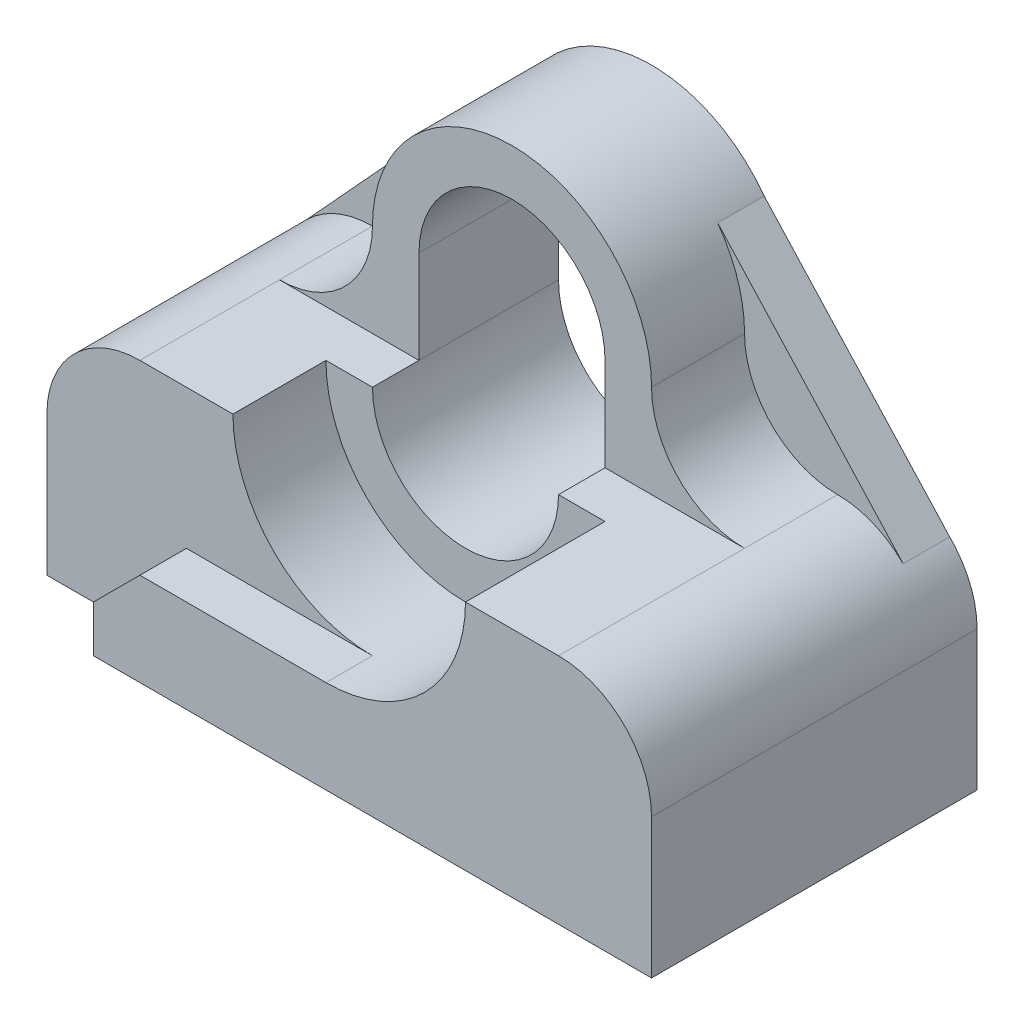
ISO-10303-21;
HEADER;
FILE_DESCRIPTION(('STEP AP214'),'2;1');
FILE_NAME('part.step','',(''),(''),'','','');
FILE_SCHEMA(('AUTOMOTIVE_DESIGN { 1 0 10303 214 1 1 1 1 }'));
ENDSEC;
DATA;
#1=APPLICATION_CONTEXT('core data for automotive mechanical design processes');
#2=APPLICATION_PROTOCOL_DEFINITION('international standard','automotive_design',2000,#1);
#3=PRODUCT_CONTEXT('',#1,'mechanical');
#4=PRODUCT('Part','Part','',(#3));
#5=PRODUCT_RELATED_PRODUCT_CATEGORY('part','',(#4));
#6=PRODUCT_DEFINITION_FORMATION('','',#4);
#7=PRODUCT_DEFINITION_CONTEXT('part definition',#1,'design');
#8=PRODUCT_DEFINITION('design','',#6,#7);
#9=PRODUCT_DEFINITION_SHAPE('','',#8);
#10=(LENGTH_UNIT() NAMED_UNIT(*) SI_UNIT(.MILLI.,.METRE.));
#11=(NAMED_UNIT(*) PLANE_ANGLE_UNIT() SI_UNIT($,.RADIAN.));
#12=(NAMED_UNIT(*) SI_UNIT($,.STERADIAN.) SOLID_ANGLE_UNIT());
#13=UNCERTAINTY_MEASURE_WITH_UNIT(LENGTH_MEASURE(1.E-05),#10,'distance_accuracy_value','');
#14=(GEOMETRIC_REPRESENTATION_CONTEXT(3) GLOBAL_UNCERTAINTY_ASSIGNED_CONTEXT((#13)) GLOBAL_UNIT_ASSIGNED_CONTEXT((#10,
#11,#12)) REPRESENTATION_CONTEXT('',''));
#15=CARTESIAN_POINT('',(0.,0.,0.));
#16=DIRECTION('',(0.,0.,1.));
#17=DIRECTION('',(1.,0.,0.));
#18=AXIS2_PLACEMENT_3D('',#15,#16,#17);
#19=CARTESIAN_POINT('',(0.,0.,4.));
#20=DIRECTION('',(0.,0.,1.));
#21=DIRECTION('',(1.,0.,0.));
#22=AXIS2_PLACEMENT_3D('',#19,#20,#21);
#23=CYLINDRICAL_SURFACE('',#22,3.);
#24=DIRECTION('',(0.,0.,1.));
#25=VECTOR('',#24,1.);
#26=CARTESIAN_POINT('',(0.,-3.,6.));
#27=LINE('',#26,#25);
#28=CARTESIAN_POINT('',(0.,-3.,6.));
#29=VERTEX_POINT('',#28);
#30=CARTESIAN_POINT('',(0.,-3.,7.));
#31=VERTEX_POINT('',#30);
#32=EDGE_CURVE('E487',#29,#31,#27,.T.);
#33=ORIENTED_EDGE('',*,*,#32,.T.);
#34=CARTESIAN_POINT('',(0.,0.,7.));
#35=DIRECTION('',(0.,0.,1.));
#36=DIRECTION('',(1.,0.,0.));
#37=AXIS2_PLACEMENT_3D('',#34,#35,#36);
#38=CIRCLE('',#37,3.);
#39=CARTESIAN_POINT('',(3.,0.,7.));
#40=VERTEX_POINT('',#39);
#41=EDGE_CURVE('E368',#31,#40,#38,.T.);
#42=ORIENTED_EDGE('',*,*,#41,.T.);
#43=DIRECTION('',(0.,0.,1.));
#44=VECTOR('',#43,1.);
#45=CARTESIAN_POINT('',(3.,0.,4.));
#46=LINE('',#45,#44);
#47=CARTESIAN_POINT('',(3.,0.,4.));
#48=VERTEX_POINT('',#47);
#49=EDGE_CURVE('E367',#48,#40,#46,.T.);
#50=ORIENTED_EDGE('',*,*,#49,.F.);
#51=CARTESIAN_POINT('',(0.,0.,4.));
#52=DIRECTION('',(0.,0.,1.));
#53=DIRECTION('',(1.,0.,0.));
#54=AXIS2_PLACEMENT_3D('',#51,#52,#53);
#55=CIRCLE('',#54,3.);
#56=CARTESIAN_POINT('',(-3.,0.,4.));
#57=VERTEX_POINT('',#56);
#58=EDGE_CURVE('E357',#57,#48,#55,.T.);
#59=ORIENTED_EDGE('',*,*,#58,.F.);
#60=DIRECTION('',(0.,0.,1.));
#61=VECTOR('',#60,1.);
#62=CARTESIAN_POINT('',(-3.,0.,4.));
#63=LINE('',#62,#61);
#64=CARTESIAN_POINT('',(-3.,0.,6.));
#65=VERTEX_POINT('',#64);
#66=EDGE_CURVE('E365',#57,#65,#63,.T.);
#67=ORIENTED_EDGE('',*,*,#66,.T.);
#68=CARTESIAN_POINT('',(0.,0.,6.));
#69=DIRECTION('',(0.,0.,-1.));
#70=DIRECTION('',(-1.,0.,0.));
#71=AXIS2_PLACEMENT_3D('',#68,#69,#70);
#72=CIRCLE('',#71,3.);
#73=EDGE_CURVE('E11',#65,#29,#72,.F.);
#74=ORIENTED_EDGE('',*,*,#73,.T.);
#75=EDGE_LOOP('',(#33,#42,#50,#59,#67,#74));
#76=FACE_BOUND('',#75,.T.);
#77=ADVANCED_FACE('F35',(#76),#23,.F.);
#78=CARTESIAN_POINT('',(0.,0.,7.));
#79=DIRECTION('',(0.,0.,-1.));
#80=DIRECTION('',(-1.,0.,0.));
#81=AXIS2_PLACEMENT_3D('',#78,#79,#80);
#82=CYLINDRICAL_SURFACE('',#81,2.);
#83=DIRECTION('',(0.,0.,-1.));
#84=VECTOR('',#83,1.);
#85=CARTESIAN_POINT('',(-2.,0.,7.));
#86=LINE('',#85,#84);
#87=CARTESIAN_POINT('',(-2.,0.,4.));
#88=VERTEX_POINT('',#87);
#89=CARTESIAN_POINT('',(-2.,0.,3.));
#90=VERTEX_POINT('',#89);
#91=EDGE_CURVE('E455',#88,#90,#86,.T.);
#92=ORIENTED_EDGE('',*,*,#91,.F.);
#93=CARTESIAN_POINT('',(0.,0.,4.));
#94=DIRECTION('',(0.,0.,1.));
#95=DIRECTION('',(1.,0.,0.));
#96=AXIS2_PLACEMENT_3D('',#93,#94,#95);
#97=CIRCLE('',#96,2.);
#98=CARTESIAN_POINT('',(2.,0.,4.));
#99=VERTEX_POINT('',#98);
#100=EDGE_CURVE('E58',#88,#99,#97,.T.);
#101=ORIENTED_EDGE('',*,*,#100,.T.);
#102=DIRECTION('',(0.,0.,-1.));
#103=VECTOR('',#102,1.);
#104=CARTESIAN_POINT('',(2.,0.,7.));
#105=LINE('',#104,#103);
#106=CARTESIAN_POINT('',(2.,0.,3.));
#107=VERTEX_POINT('',#106);
#108=EDGE_CURVE('E462',#99,#107,#105,.T.);
#109=ORIENTED_EDGE('',*,*,#108,.T.);
#110=CARTESIAN_POINT('',(2.,0.,0.));
#111=VERTEX_POINT('',#110);
#112=EDGE_CURVE('E461',#107,#111,#105,.T.);
#113=ORIENTED_EDGE('',*,*,#112,.T.);
#114=CARTESIAN_POINT('',(0.,0.,0.));
#115=DIRECTION('',(0.,0.,1.));
#116=DIRECTION('',(1.,0.,0.));
#117=AXIS2_PLACEMENT_3D('',#114,#115,#116);
#118=CIRCLE('',#117,2.);
#119=CARTESIAN_POINT('',(-2.,0.,0.));
#120=VERTEX_POINT('',#119);
#121=EDGE_CURVE('E439',#120,#111,#118,.T.);
#122=ORIENTED_EDGE('',*,*,#121,.F.);
#123=EDGE_CURVE('E454',#90,#120,#86,.T.);
#124=ORIENTED_EDGE('',*,*,#123,.F.);
#125=EDGE_LOOP('',(#92,#101,#109,#113,#122,#124));
#126=FACE_BOUND('',#125,.T.);
#127=ADVANCED_FACE('F262',(#126),#82,.F.);
#128=CARTESIAN_POINT('',(-5.,2.,0.));
#129=DIRECTION('',(0.,0.,-1.));
#130=DIRECTION('',(-1.,0.,0.));
#131=AXIS2_PLACEMENT_3D('',#128,#129,#130);
#132=PLANE('',#131);
#133=CARTESIAN_POINT('',(-5.,-2.,0.));
#134=DIRECTION('',(0.,0.,1.));
#135=DIRECTION('',(-0.705403640509108,0.708805829516446,0.));
#136=AXIS2_PLACEMENT_3D('',#133,#134,#135);
#137=CIRCLE('',#136,2.);
#138=CARTESIAN_POINT('',(-6.41080728101822,-0.582388340967108,0.));
#139=VERTEX_POINT('',#138);
#140=CARTESIAN_POINT('',(-6.5351138951097,-0.718038483790902,0.));
#141=VERTEX_POINT('',#140);
#142=EDGE_CURVE('E239',#139,#141,#137,.T.);
#143=ORIENTED_EDGE('',*,*,#142,.F.);
#144=DIRECTION('',(0.675608404643225,0.737260661893361,0.));
#145=VECTOR('',#144,1.);
#146=CARTESIAN_POINT('',(-3.19452800676518,2.92739065271178,0.));
#147=LINE('',#146,#145);
#148=CARTESIAN_POINT('',(-2.42153608406019,3.77092150972154,0.));
#149=VERTEX_POINT('',#148);
#150=EDGE_CURVE('E404',#139,#149,#147,.T.);
#151=ORIENTED_EDGE('',*,*,#150,.T.);
#152=CARTESIAN_POINT('',(0.,2.,0.));
#153=DIRECTION('',(0.,0.,1.));
#154=DIRECTION('',(1.,0.,0.));
#155=AXIS2_PLACEMENT_3D('',#152,#153,#154);
#156=CIRCLE('',#155,3.);
#157=CARTESIAN_POINT('',(2.42153608406019,3.77092150972154,0.));
#158=VERTEX_POINT('',#157);
#159=EDGE_CURVE('E283',#158,#149,#156,.T.);
#160=ORIENTED_EDGE('',*,*,#159,.F.);
#161=DIRECTION('',(-0.675608404643225,0.737260661893361,0.));
#162=VECTOR('',#161,1.);
#163=CARTESIAN_POINT('',(3.19452800676518,2.92739065271178,0.));
#164=LINE('',#163,#162);
#165=CARTESIAN_POINT('',(6.41080728101822,-0.582388340967108,0.));
#166=VERTEX_POINT('',#165);
#167=EDGE_CURVE('E317',#166,#158,#164,.T.);
#168=ORIENTED_EDGE('',*,*,#167,.F.);
#169=CARTESIAN_POINT('',(5.,-2.,0.));
#170=DIRECTION('',(0.,0.,1.));
#171=DIRECTION('',(0.767556947554849,0.640980758104549,0.));
#172=AXIS2_PLACEMENT_3D('',#169,#170,#171);
#173=CIRCLE('',#172,2.);
#174=CARTESIAN_POINT('',(6.5351138951097,-0.718038483790902,0.));
#175=VERTEX_POINT('',#174);
#176=EDGE_CURVE('E315',#175,#166,#173,.T.);
#177=ORIENTED_EDGE('',*,*,#176,.F.);
#178=CARTESIAN_POINT('',(5.,-2.,0.));
#179=DIRECTION('',(0.,0.,1.));
#180=DIRECTION('',(-1.,0.,0.));
#181=AXIS2_PLACEMENT_3D('',#178,#179,#180);
#182=CIRCLE('',#181,2.);
#183=CARTESIAN_POINT('',(7.,-2.,0.));
#184=VERTEX_POINT('',#183);
#185=EDGE_CURVE('E274',#184,#175,#182,.T.);
#186=ORIENTED_EDGE('',*,*,#185,.F.);
#187=DIRECTION('',(0.,1.,0.));
#188=VECTOR('',#187,1.);
#189=CARTESIAN_POINT('',(7.,-2.,0.));
#190=LINE('',#189,#188);
#191=CARTESIAN_POINT('',(7.,-5.,0.));
#192=VERTEX_POINT('',#191);
#193=EDGE_CURVE('E284',#192,#184,#190,.T.);
#194=ORIENTED_EDGE('',*,*,#193,.F.);
#195=DIRECTION('',(1.,0.,0.));
#196=VECTOR('',#195,1.);
#197=CARTESIAN_POINT('',(-7.,-5.,0.));
#198=LINE('',#197,#196);
#199=CARTESIAN_POINT('',(-7.,-5.,0.));
#200=VERTEX_POINT('',#199);
#201=EDGE_CURVE('E312',#200,#192,#198,.T.);
#202=ORIENTED_EDGE('',*,*,#201,.F.);
#203=DIRECTION('',(0.,-1.,0.));
#204=VECTOR('',#203,1.);
#205=CARTESIAN_POINT('',(-7.,-2.,0.));
#206=LINE('',#205,#204);
#207=CARTESIAN_POINT('',(-7.,-2.,0.));
#208=VERTEX_POINT('',#207);
#209=EDGE_CURVE('E226',#208,#200,#206,.T.);
#210=ORIENTED_EDGE('',*,*,#209,.F.);
#211=CARTESIAN_POINT('',(-5.,-2.,0.));
#212=DIRECTION('',(0.,0.,1.));
#213=DIRECTION('',(1.,0.,0.));
#214=AXIS2_PLACEMENT_3D('',#211,#212,#213);
#215=CIRCLE('',#214,2.);
#216=EDGE_CURVE('E249',#141,#208,#215,.T.);
#217=ORIENTED_EDGE('',*,*,#216,.F.);
#218=EDGE_LOOP('',(#143,#151,#160,#168,#177,#186,#194,#202,#210,#217));
#219=FACE_BOUND('',#218,.T.);
#220=DIRECTION('',(0.,-1.,0.));
#221=VECTOR('',#220,1.);
#222=CARTESIAN_POINT('',(-2.,0.,0.));
#223=LINE('',#222,#221);
#224=CARTESIAN_POINT('',(-2.,2.,0.));
#225=VERTEX_POINT('',#224);
#226=EDGE_CURVE('E451',#225,#120,#223,.T.);
#227=ORIENTED_EDGE('',*,*,#226,.T.);
#228=ORIENTED_EDGE('',*,*,#121,.T.);
#229=DIRECTION('',(0.,1.,0.));
#230=VECTOR('',#229,1.);
#231=CARTESIAN_POINT('',(2.,0.,0.));
#232=LINE('',#231,#230);
#233=CARTESIAN_POINT('',(2.,2.,0.));
#234=VERTEX_POINT('',#233);
#235=EDGE_CURVE('E445',#111,#234,#232,.T.);
#236=ORIENTED_EDGE('',*,*,#235,.T.);
#237=CARTESIAN_POINT('',(0.,2.,0.));
#238=DIRECTION('',(0.,0.,1.));
#239=DIRECTION('',(1.,0.,0.));
#240=AXIS2_PLACEMENT_3D('',#237,#238,#239);
#241=CIRCLE('',#240,2.);
#242=EDGE_CURVE('E448',#234,#225,#241,.T.);
#243=ORIENTED_EDGE('',*,*,#242,.T.);
#244=EDGE_LOOP('',(#227,#228,#236,#243));
#245=FACE_BOUND('',#244,.T.);
#246=ADVANCED_FACE('F252',(#219,#245),#132,.T.);
#247=CARTESIAN_POINT('',(-5.,2.,7.));
#248=DIRECTION('',(0.,0.,-1.));
#249=DIRECTION('',(-1.,0.,0.));
#250=AXIS2_PLACEMENT_3D('',#247,#248,#249);
#251=CYLINDRICAL_SURFACE('',#250,2.);
#252=DIRECTION('',(0.,0.,-1.));
#253=VECTOR('',#252,1.);
#254=CARTESIAN_POINT('',(-5.,0.,7.));
#255=LINE('',#254,#253);
#256=CARTESIAN_POINT('',(-5.00000000000001,0.,3.));
#257=VERTEX_POINT('',#256);
#258=CARTESIAN_POINT('',(-5.,0.,1.));
#259=VERTEX_POINT('',#258);
#260=EDGE_CURVE('E231',#257,#259,#255,.T.);
#261=ORIENTED_EDGE('',*,*,#260,.F.);
#262=CARTESIAN_POINT('',(-5.,2.,3.));
#263=DIRECTION('',(0.,0.,-1.));
#264=DIRECTION('',(-1.,0.,0.));
#265=AXIS2_PLACEMENT_3D('',#262,#263,#264);
#266=CIRCLE('',#265,2.);
#267=CARTESIAN_POINT('',(-3.,2.,3.));
#268=VERTEX_POINT('',#267);
#269=EDGE_CURVE('E397',#257,#268,#266,.F.);
#270=ORIENTED_EDGE('',*,*,#269,.T.);
#271=DIRECTION('',(0.,0.,-1.));
#272=VECTOR('',#271,1.);
#273=CARTESIAN_POINT('',(-3.,2.,7.));
#274=LINE('',#273,#272);
#275=CARTESIAN_POINT('',(-3.,2.,1.));
#276=VERTEX_POINT('',#275);
#277=EDGE_CURVE('E292',#268,#276,#274,.T.);
#278=ORIENTED_EDGE('',*,*,#277,.T.);
#279=CARTESIAN_POINT('',(-5.,2.,1.));
#280=DIRECTION('',(0.,0.,-1.));
#281=DIRECTION('',(-1.,0.,0.));
#282=AXIS2_PLACEMENT_3D('',#279,#280,#281);
#283=CIRCLE('',#282,2.);
#284=EDGE_CURVE('E416',#259,#276,#283,.F.);
#285=ORIENTED_EDGE('',*,*,#284,.F.);
#286=EDGE_LOOP('',(#261,#270,#278,#285));
#287=FACE_BOUND('',#286,.T.);
#288=ADVANCED_FACE('F37',(#287),#251,.F.);
#289=CARTESIAN_POINT('',(5.,-2.,7.));
#290=DIRECTION('',(0.,0.,-1.));
#291=DIRECTION('',(-1.,0.,0.));
#292=AXIS2_PLACEMENT_3D('',#289,#290,#291);
#293=CYLINDRICAL_SURFACE('',#292,2.);
#294=ORIENTED_EDGE('',*,*,#185,.T.);
#295=ORIENTED_EDGE('',*,*,#176,.T.);
#296=DIRECTION('',(0.,0.,-1.));
#297=VECTOR('',#296,1.);
#298=CARTESIAN_POINT('',(6.41080728101822,-0.582388340967115,7.));
#299=LINE('',#298,#297);
#300=CARTESIAN_POINT('',(6.41080728101822,-0.582388340967108,1.));
#301=VERTEX_POINT('',#300);
#302=EDGE_CURVE('E434',#301,#166,#299,.T.);
#303=ORIENTED_EDGE('',*,*,#302,.F.);
#304=CARTESIAN_POINT('',(5.,-2.,1.));
#305=DIRECTION('',(0.,0.,-1.));
#306=DIRECTION('',(-1.,0.,0.));
#307=AXIS2_PLACEMENT_3D('',#304,#305,#306);
#308=CIRCLE('',#307,2.);
#309=CARTESIAN_POINT('',(5.,0.,1.));
#310=VERTEX_POINT('',#309);
#311=EDGE_CURVE('E426',#310,#301,#308,.T.);
#312=ORIENTED_EDGE('',*,*,#311,.F.);
#313=DIRECTION('',(0.,0.,-1.));
#314=VECTOR('',#313,1.);
#315=CARTESIAN_POINT('',(5.,0.,7.));
#316=LINE('',#315,#314);
#317=CARTESIAN_POINT('',(5.,0.,3.));
#318=VERTEX_POINT('',#317);
#319=EDGE_CURVE('E297',#318,#310,#316,.T.);
#320=ORIENTED_EDGE('',*,*,#319,.F.);
#321=CARTESIAN_POINT('',(5.,0.,7.));
#322=VERTEX_POINT('',#321);
#323=EDGE_CURVE('E298',#322,#318,#316,.T.);
#324=ORIENTED_EDGE('',*,*,#323,.F.);
#325=CARTESIAN_POINT('',(5.,-2.,7.));
#326=DIRECTION('',(0.,0.,1.));
#327=DIRECTION('',(-1.,0.,0.));
#328=AXIS2_PLACEMENT_3D('',#325,#326,#327);
#329=CIRCLE('',#328,2.);
#330=CARTESIAN_POINT('',(7.,-2.,7.));
#331=VERTEX_POINT('',#330);
#332=EDGE_CURVE('E295',#331,#322,#329,.T.);
#333=ORIENTED_EDGE('',*,*,#332,.F.);
#334=DIRECTION('',(0.,0.,-1.));
#335=VECTOR('',#334,1.);
#336=CARTESIAN_POINT('',(7.,-2.,7.));
#337=LINE('',#336,#335);
#338=EDGE_CURVE('E233',#331,#184,#337,.T.);
#339=ORIENTED_EDGE('',*,*,#338,.T.);
#340=EDGE_LOOP('',(#294,#295,#303,#312,#320,#324,#333,#339));
#341=FACE_BOUND('',#340,.T.);
#342=ADVANCED_FACE('F303',(#341),#293,.T.);
#343=CARTESIAN_POINT('',(5.,2.,7.));
#344=DIRECTION('',(0.,0.,-1.));
#345=DIRECTION('',(-1.,0.,0.));
#346=AXIS2_PLACEMENT_3D('',#343,#344,#345);
#347=CYLINDRICAL_SURFACE('',#346,2.);
#348=DIRECTION('',(0.,0.,-1.));
#349=VECTOR('',#348,1.);
#350=CARTESIAN_POINT('',(3.,2.,7.));
#351=LINE('',#350,#349);
#352=CARTESIAN_POINT('',(3.,2.,3.));
#353=VERTEX_POINT('',#352);
#354=CARTESIAN_POINT('',(3.,2.,1.));
#355=VERTEX_POINT('',#354);
#356=EDGE_CURVE('E294',#353,#355,#351,.T.);
#357=ORIENTED_EDGE('',*,*,#356,.F.);
#358=CARTESIAN_POINT('',(5.,2.,3.));
#359=DIRECTION('',(0.,0.,-1.));
#360=DIRECTION('',(-1.,0.,0.));
#361=AXIS2_PLACEMENT_3D('',#358,#359,#360);
#362=CIRCLE('',#361,2.);
#363=EDGE_CURVE('E394',#353,#318,#362,.F.);
#364=ORIENTED_EDGE('',*,*,#363,.T.);
#365=ORIENTED_EDGE('',*,*,#319,.T.);
#366=CARTESIAN_POINT('',(5.,2.,1.));
#367=DIRECTION('',(0.,0.,-1.));
#368=DIRECTION('',(-1.,0.,0.));
#369=AXIS2_PLACEMENT_3D('',#366,#367,#368);
#370=CIRCLE('',#369,2.);
#371=EDGE_CURVE('E423',#355,#310,#370,.F.);
#372=ORIENTED_EDGE('',*,*,#371,.F.);
#373=EDGE_LOOP('',(#357,#364,#365,#372));
#374=FACE_BOUND('',#373,.T.);
#375=ADVANCED_FACE('F346',(#374),#347,.F.);
#376=CARTESIAN_POINT('',(0.,2.,7.));
#377=DIRECTION('',(0.,0.,-1.));
#378=DIRECTION('',(-1.,0.,0.));
#379=AXIS2_PLACEMENT_3D('',#376,#377,#378);
#380=CYLINDRICAL_SURFACE('',#379,3.);
#381=ORIENTED_EDGE('',*,*,#277,.F.);
#382=CARTESIAN_POINT('',(0.,2.,3.));
#383=DIRECTION('',(0.,0.,-1.));
#384=DIRECTION('',(-1.,0.,0.));
#385=AXIS2_PLACEMENT_3D('',#382,#383,#384);
#386=CIRCLE('',#385,3.);
#387=EDGE_CURVE('E391',#268,#353,#386,.T.);
#388=ORIENTED_EDGE('',*,*,#387,.T.);
#389=ORIENTED_EDGE('',*,*,#356,.T.);
#390=CARTESIAN_POINT('',(0.,2.,1.));
#391=DIRECTION('',(0.,0.,-1.));
#392=DIRECTION('',(-1.,0.,0.));
#393=AXIS2_PLACEMENT_3D('',#390,#391,#392);
#394=CIRCLE('',#393,3.);
#395=CARTESIAN_POINT('',(2.42153608406019,3.77092150972154,1.));
#396=VERTEX_POINT('',#395);
#397=EDGE_CURVE('E417',#396,#355,#394,.T.);
#398=ORIENTED_EDGE('',*,*,#397,.F.);
#399=DIRECTION('',(0.,0.,-1.));
#400=VECTOR('',#399,1.);
#401=CARTESIAN_POINT('',(2.42153608406019,3.77092150972154,1.));
#402=LINE('',#401,#400);
#403=EDGE_CURVE('E408',#396,#158,#402,.T.);
#404=ORIENTED_EDGE('',*,*,#403,.T.);
#405=ORIENTED_EDGE('',*,*,#159,.T.);
#406=DIRECTION('',(0.,0.,-1.));
#407=VECTOR('',#406,1.);
#408=CARTESIAN_POINT('',(-2.42153608406019,3.77092150972154,1.));
#409=LINE('',#408,#407);
#410=CARTESIAN_POINT('',(-2.42153608406019,3.77092150972154,1.));
#411=VERTEX_POINT('',#410);
#412=EDGE_CURVE('E407',#411,#149,#409,.T.);
#413=ORIENTED_EDGE('',*,*,#412,.F.);
#414=EDGE_CURVE('E411',#276,#411,#394,.T.);
#415=ORIENTED_EDGE('',*,*,#414,.F.);
#416=EDGE_LOOP('',(#381,#388,#389,#398,#404,#405,#413,#415));
#417=FACE_BOUND('',#416,.T.);
#418=ADVANCED_FACE('F265',(#417),#380,.T.);
#419=CARTESIAN_POINT('',(-5.,2.,7.));
#420=DIRECTION('',(0.,0.,-1.));
#421=DIRECTION('',(-1.,0.,0.));
#422=AXIS2_PLACEMENT_3D('',#419,#420,#421);
#423=PLANE('',#422);
#424=ORIENTED_EDGE('',*,*,#41,.F.);
#425=DIRECTION('',(1.,0.,0.));
#426=VECTOR('',#425,1.);
#427=CARTESIAN_POINT('',(0.,-3.,7.));
#428=LINE('',#427,#426);
#429=CARTESIAN_POINT('',(-4.,-3.,7.));
#430=VERTEX_POINT('',#429);
#431=EDGE_CURVE('E481',#430,#31,#428,.T.);
#432=ORIENTED_EDGE('',*,*,#431,.F.);
#433=DIRECTION('',(0.707106781186548,0.707106781186547,0.));
#434=VECTOR('',#433,1.);
#435=CARTESIAN_POINT('',(-4.,-3.,7.));
#436=LINE('',#435,#434);
#437=CARTESIAN_POINT('',(-5.,-4.,7.));
#438=VERTEX_POINT('',#437);
#439=EDGE_CURVE('E478',#438,#430,#436,.T.);
#440=ORIENTED_EDGE('',*,*,#439,.F.);
#441=DIRECTION('',(0.,1.,0.));
#442=VECTOR('',#441,1.);
#443=CARTESIAN_POINT('',(-5.,-4.,7.));
#444=LINE('',#443,#442);
#445=CARTESIAN_POINT('',(-5.,-5.,7.));
#446=VERTEX_POINT('',#445);
#447=EDGE_CURVE('E475',#446,#438,#444,.T.);
#448=ORIENTED_EDGE('',*,*,#447,.F.);
#449=DIRECTION('',(1.,0.,0.));
#450=VECTOR('',#449,1.);
#451=CARTESIAN_POINT('',(-7.,-5.,7.));
#452=LINE('',#451,#450);
#453=CARTESIAN_POINT('',(7.,-5.,7.));
#454=VERTEX_POINT('',#453);
#455=EDGE_CURVE('E291',#446,#454,#452,.T.);
#456=ORIENTED_EDGE('',*,*,#455,.T.);
#457=DIRECTION('',(0.,1.,0.));
#458=VECTOR('',#457,1.);
#459=CARTESIAN_POINT('',(7.,-2.,7.));
#460=LINE('',#459,#458);
#461=EDGE_CURVE('E465',#454,#331,#460,.T.);
#462=ORIENTED_EDGE('',*,*,#461,.T.);
#463=ORIENTED_EDGE('',*,*,#332,.T.);
#464=DIRECTION('',(1.,0.,0.));
#465=VECTOR('',#464,1.);
#466=CARTESIAN_POINT('',(-5.00000000000001,0.,7.));
#467=LINE('',#466,#465);
#468=EDGE_CURVE('E380',#40,#322,#467,.T.);
#469=ORIENTED_EDGE('',*,*,#468,.F.);
#470=EDGE_LOOP('',(#424,#432,#440,#448,#456,#462,#463,#469));
#471=FACE_BOUND('',#470,.T.);
#472=ADVANCED_FACE('F263',(#471),#423,.F.);
#473=CARTESIAN_POINT('',(-5.,-2.,7.));
#474=DIRECTION('',(0.,0.,-1.));
#475=DIRECTION('',(-1.,0.,0.));
#476=AXIS2_PLACEMENT_3D('',#473,#474,#475);
#477=CYLINDRICAL_SURFACE('',#476,2.);
#478=DIRECTION('',(0.,0.,-1.));
#479=VECTOR('',#478,1.);
#480=CARTESIAN_POINT('',(-7.,-2.,7.));
#481=LINE('',#480,#479);
#482=CARTESIAN_POINT('',(-7.,-2.,6.));
#483=VERTEX_POINT('',#482);
#484=EDGE_CURVE('E228',#483,#208,#481,.T.);
#485=ORIENTED_EDGE('',*,*,#484,.F.);
#486=CARTESIAN_POINT('',(-5.,-2.,6.));
#487=DIRECTION('',(0.,0.,-1.));
#488=DIRECTION('',(-1.,0.,0.));
#489=AXIS2_PLACEMENT_3D('',#486,#487,#488);
#490=CIRCLE('',#489,2.);
#491=CARTESIAN_POINT('',(-5.00000000000001,0.,6.));
#492=VERTEX_POINT('',#491);
#493=EDGE_CURVE('E209',#483,#492,#490,.T.);
#494=ORIENTED_EDGE('',*,*,#493,.T.);
#495=EDGE_CURVE('E237',#492,#257,#255,.T.);
#496=ORIENTED_EDGE('',*,*,#495,.T.);
#497=ORIENTED_EDGE('',*,*,#260,.T.);
#498=CARTESIAN_POINT('',(-5.,-2.,1.));
#499=DIRECTION('',(0.,0.,-1.));
#500=DIRECTION('',(-1.,0.,0.));
#501=AXIS2_PLACEMENT_3D('',#498,#499,#500);
#502=CIRCLE('',#501,2.);
#503=CARTESIAN_POINT('',(-6.41080728101822,-0.582388340967108,1.));
#504=VERTEX_POINT('',#503);
#505=EDGE_CURVE('E420',#504,#259,#502,.T.);
#506=ORIENTED_EDGE('',*,*,#505,.F.);
#507=DIRECTION('',(0.,0.,-1.));
#508=VECTOR('',#507,1.);
#509=CARTESIAN_POINT('',(-6.41080728101822,-0.582388340967115,7.));
#510=LINE('',#509,#508);
#511=EDGE_CURVE('E325',#504,#139,#510,.T.);
#512=ORIENTED_EDGE('',*,*,#511,.T.);
#513=ORIENTED_EDGE('',*,*,#142,.T.);
#514=ORIENTED_EDGE('',*,*,#216,.T.);
#515=EDGE_LOOP('',(#485,#494,#496,#497,#506,#512,#513,#514));
#516=FACE_BOUND('',#515,.T.);
#517=ADVANCED_FACE('F323',(#516),#477,.T.);
#518=CARTESIAN_POINT('',(-7.,-2.,7.));
#519=DIRECTION('',(1.,0.,0.));
#520=DIRECTION('',(0.,1.,0.));
#521=AXIS2_PLACEMENT_3D('',#518,#519,#520);
#522=PLANE('',#521);
#523=DIRECTION('',(0.,0.,-1.));
#524=VECTOR('',#523,1.);
#525=CARTESIAN_POINT('',(-7.,-5.,7.));
#526=LINE('',#525,#524);
#527=CARTESIAN_POINT('',(-7.,-5.,6.));
#528=VERTEX_POINT('',#527);
#529=EDGE_CURVE('E219',#528,#200,#526,.T.);
#530=ORIENTED_EDGE('',*,*,#529,.F.);
#531=DIRECTION('',(0.,-1.,0.));
#532=VECTOR('',#531,1.);
#533=CARTESIAN_POINT('',(-7.,-5.,6.));
#534=LINE('',#533,#532);
#535=EDGE_CURVE('E202',#483,#528,#534,.T.);
#536=ORIENTED_EDGE('',*,*,#535,.F.);
#537=ORIENTED_EDGE('',*,*,#484,.T.);
#538=ORIENTED_EDGE('',*,*,#209,.T.);
#539=EDGE_LOOP('',(#530,#536,#537,#538));
#540=FACE_BOUND('',#539,.T.);
#541=ADVANCED_FACE('F224',(#540),#522,.F.);
#542=CARTESIAN_POINT('',(-7.,-5.,7.));
#543=DIRECTION('',(0.,1.,0.));
#544=DIRECTION('',(0.,0.,1.));
#545=AXIS2_PLACEMENT_3D('',#542,#543,#544);
#546=PLANE('',#545);
#547=ORIENTED_EDGE('',*,*,#455,.F.);
#548=DIRECTION('',(0.,0.,1.));
#549=VECTOR('',#548,1.);
#550=CARTESIAN_POINT('',(-5.,-5.,6.));
#551=LINE('',#550,#549);
#552=CARTESIAN_POINT('',(-5.,-5.,6.));
#553=VERTEX_POINT('',#552);
#554=EDGE_CURVE('E221',#553,#446,#551,.T.);
#555=ORIENTED_EDGE('',*,*,#554,.F.);
#556=DIRECTION('',(1.,0.,0.));
#557=VECTOR('',#556,1.);
#558=CARTESIAN_POINT('',(-5.,-5.,6.));
#559=LINE('',#558,#557);
#560=EDGE_CURVE('E206',#528,#553,#559,.T.);
#561=ORIENTED_EDGE('',*,*,#560,.F.);
#562=ORIENTED_EDGE('',*,*,#529,.T.);
#563=ORIENTED_EDGE('',*,*,#201,.T.);
#564=DIRECTION('',(0.,0.,-1.));
#565=VECTOR('',#564,1.);
#566=CARTESIAN_POINT('',(7.,-5.,7.));
#567=LINE('',#566,#565);
#568=EDGE_CURVE('E229',#454,#192,#567,.T.);
#569=ORIENTED_EDGE('',*,*,#568,.F.);
#570=EDGE_LOOP('',(#547,#555,#561,#562,#563,#569));
#571=FACE_BOUND('',#570,.T.);
#572=ADVANCED_FACE('F217',(#571),#546,.F.);
#573=CARTESIAN_POINT('',(7.,-2.,7.));
#574=DIRECTION('',(-1.,0.,0.));
#575=DIRECTION('',(0.,-1.,0.));
#576=AXIS2_PLACEMENT_3D('',#573,#574,#575);
#577=PLANE('',#576);
#578=ORIENTED_EDGE('',*,*,#193,.T.);
#579=ORIENTED_EDGE('',*,*,#338,.F.);
#580=ORIENTED_EDGE('',*,*,#461,.F.);
#581=ORIENTED_EDGE('',*,*,#568,.T.);
#582=EDGE_LOOP('',(#578,#579,#580,#581));
#583=FACE_BOUND('',#582,.T.);
#584=ADVANCED_FACE('F310',(#583),#577,.F.);
#585=CARTESIAN_POINT('',(2.,0.,7.));
#586=DIRECTION('',(-1.,0.,0.));
#587=DIRECTION('',(0.,0.,1.));
#588=AXIS2_PLACEMENT_3D('',#585,#586,#587);
#589=PLANE('',#588);
#590=DIRECTION('',(0.,-1.,0.));
#591=VECTOR('',#590,1.);
#592=CARTESIAN_POINT('',(2.,0.,3.));
#593=LINE('',#592,#591);
#594=CARTESIAN_POINT('',(2.,2.,3.));
#595=VERTEX_POINT('',#594);
#596=EDGE_CURVE('E388',#595,#107,#593,.T.);
#597=ORIENTED_EDGE('',*,*,#596,.F.);
#598=DIRECTION('',(0.,0.,-1.));
#599=VECTOR('',#598,1.);
#600=CARTESIAN_POINT('',(2.,2.,7.));
#601=LINE('',#600,#599);
#602=EDGE_CURVE('E459',#595,#234,#601,.T.);
#603=ORIENTED_EDGE('',*,*,#602,.T.);
#604=ORIENTED_EDGE('',*,*,#235,.F.);
#605=ORIENTED_EDGE('',*,*,#112,.F.);
#606=EDGE_LOOP('',(#597,#603,#604,#605));
#607=FACE_BOUND('',#606,.T.);
#608=ADVANCED_FACE('F343',(#607),#589,.T.);
#609=CARTESIAN_POINT('',(0.,2.,7.));
#610=DIRECTION('',(0.,0.,-1.));
#611=DIRECTION('',(-1.,0.,0.));
#612=AXIS2_PLACEMENT_3D('',#609,#610,#611);
#613=CYLINDRICAL_SURFACE('',#612,2.);
#614=CARTESIAN_POINT('',(0.,2.,3.));
#615=DIRECTION('',(0.,0.,-1.));
#616=DIRECTION('',(-1.,0.,0.));
#617=AXIS2_PLACEMENT_3D('',#614,#615,#616);
#618=CIRCLE('',#617,2.);
#619=CARTESIAN_POINT('',(-2.,2.,3.));
#620=VERTEX_POINT('',#619);
#621=EDGE_CURVE('E384',#620,#595,#618,.T.);
#622=ORIENTED_EDGE('',*,*,#621,.F.);
#623=DIRECTION('',(0.,0.,-1.));
#624=VECTOR('',#623,1.);
#625=CARTESIAN_POINT('',(-2.,2.,7.));
#626=LINE('',#625,#624);
#627=EDGE_CURVE('E457',#620,#225,#626,.T.);
#628=ORIENTED_EDGE('',*,*,#627,.T.);
#629=ORIENTED_EDGE('',*,*,#242,.F.);
#630=ORIENTED_EDGE('',*,*,#602,.F.);
#631=EDGE_LOOP('',(#622,#628,#629,#630));
#632=FACE_BOUND('',#631,.T.);
#633=ADVANCED_FACE('F514',(#632),#613,.F.);
#634=CARTESIAN_POINT('',(-2.,0.,7.));
#635=DIRECTION('',(1.,0.,0.));
#636=DIRECTION('',(0.,0.,-1.));
#637=AXIS2_PLACEMENT_3D('',#634,#635,#636);
#638=PLANE('',#637);
#639=DIRECTION('',(0.,1.,0.));
#640=VECTOR('',#639,1.);
#641=CARTESIAN_POINT('',(-2.,0.,3.));
#642=LINE('',#641,#640);
#643=EDGE_CURVE('E319',#90,#620,#642,.T.);
#644=ORIENTED_EDGE('',*,*,#643,.F.);
#645=ORIENTED_EDGE('',*,*,#123,.T.);
#646=ORIENTED_EDGE('',*,*,#226,.F.);
#647=ORIENTED_EDGE('',*,*,#627,.F.);
#648=EDGE_LOOP('',(#644,#645,#646,#647));
#649=FACE_BOUND('',#648,.T.);
#650=ADVANCED_FACE('F510',(#649),#638,.T.);
#651=CARTESIAN_POINT('',(0.,0.,1.));
#652=DIRECTION('',(0.,0.,-1.));
#653=DIRECTION('',(-1.,0.,0.));
#654=AXIS2_PLACEMENT_3D('',#651,#652,#653);
#655=PLANE('',#654);
#656=DIRECTION('',(0.675608404643225,0.737260661893361,0.));
#657=VECTOR('',#656,1.);
#658=CARTESIAN_POINT('',(-3.19452800676518,2.92739065271178,1.));
#659=LINE('',#658,#657);
#660=EDGE_CURVE('E403',#504,#411,#659,.T.);
#661=ORIENTED_EDGE('',*,*,#660,.F.);
#662=ORIENTED_EDGE('',*,*,#505,.T.);
#663=ORIENTED_EDGE('',*,*,#284,.T.);
#664=ORIENTED_EDGE('',*,*,#414,.T.);
#665=EDGE_LOOP('',(#661,#662,#663,#664));
#666=FACE_BOUND('',#665,.T.);
#667=ADVANCED_FACE('F547',(#666),#655,.F.);
#668=CARTESIAN_POINT('',(-3.19452800676518,2.92739065271178,1.));
#669=DIRECTION('',(-0.737260661893361,0.675608404643225,0.));
#670=DIRECTION('',(-0.675608404643225,-0.737260661893361,0.));
#671=AXIS2_PLACEMENT_3D('',#668,#669,#670);
#672=PLANE('',#671);
#673=ORIENTED_EDGE('',*,*,#511,.F.);
#674=ORIENTED_EDGE('',*,*,#660,.T.);
#675=ORIENTED_EDGE('',*,*,#412,.T.);
#676=ORIENTED_EDGE('',*,*,#150,.F.);
#677=EDGE_LOOP('',(#673,#674,#675,#676));
#678=FACE_BOUND('',#677,.T.);
#679=ADVANCED_FACE('F548',(#678),#672,.T.);
#680=CARTESIAN_POINT('',(3.19452800676518,2.92739065271178,1.));
#681=DIRECTION('',(-0.737260661893361,-0.675608404643225,0.));
#682=DIRECTION('',(0.675608404643225,-0.737260661893361,0.));
#683=AXIS2_PLACEMENT_3D('',#680,#681,#682);
#684=PLANE('',#683);
#685=DIRECTION('',(-0.675608404643225,0.737260661893361,0.));
#686=VECTOR('',#685,1.);
#687=CARTESIAN_POINT('',(3.19452800676518,2.92739065271178,1.));
#688=LINE('',#687,#686);
#689=EDGE_CURVE('E400',#301,#396,#688,.T.);
#690=ORIENTED_EDGE('',*,*,#689,.F.);
#691=ORIENTED_EDGE('',*,*,#302,.T.);
#692=ORIENTED_EDGE('',*,*,#167,.T.);
#693=ORIENTED_EDGE('',*,*,#403,.F.);
#694=EDGE_LOOP('',(#690,#691,#692,#693));
#695=FACE_BOUND('',#694,.T.);
#696=ADVANCED_FACE('F545',(#695),#684,.F.);
#697=ORIENTED_EDGE('',*,*,#371,.T.);
#698=ORIENTED_EDGE('',*,*,#311,.T.);
#699=ORIENTED_EDGE('',*,*,#689,.T.);
#700=ORIENTED_EDGE('',*,*,#397,.T.);
#701=EDGE_LOOP('',(#697,#698,#699,#700));
#702=FACE_BOUND('',#701,.T.);
#703=ADVANCED_FACE('F542',(#702),#655,.F.);
#704=CARTESIAN_POINT('',(-5.00000000000001,0.,3.));
#705=DIRECTION('',(0.,-1.,0.));
#706=DIRECTION('',(0.,0.,-1.));
#707=AXIS2_PLACEMENT_3D('',#704,#705,#706);
#708=PLANE('',#707);
#709=DIRECTION('',(-1.,0.,0.));
#710=VECTOR('',#709,1.);
#711=CARTESIAN_POINT('',(-5.00000000000001,0.,4.));
#712=LINE('',#711,#710);
#713=EDGE_CURVE('E378',#48,#99,#712,.T.);
#714=ORIENTED_EDGE('',*,*,#713,.F.);
#715=ORIENTED_EDGE('',*,*,#49,.T.);
#716=ORIENTED_EDGE('',*,*,#468,.T.);
#717=ORIENTED_EDGE('',*,*,#323,.T.);
#718=DIRECTION('',(1.,0.,0.));
#719=VECTOR('',#718,1.);
#720=CARTESIAN_POINT('',(-5.00000000000001,0.,3.));
#721=LINE('',#720,#719);
#722=EDGE_CURVE('E385',#107,#318,#721,.T.);
#723=ORIENTED_EDGE('',*,*,#722,.F.);
#724=ORIENTED_EDGE('',*,*,#108,.F.);
#725=EDGE_LOOP('',(#714,#715,#716,#717,#723,#724));
#726=FACE_BOUND('',#725,.T.);
#727=ADVANCED_FACE('F495',(#726),#708,.F.);
#728=CARTESIAN_POINT('',(0.,0.,3.));
#729=DIRECTION('',(0.,0.,-1.));
#730=DIRECTION('',(-1.,0.,0.));
#731=AXIS2_PLACEMENT_3D('',#728,#729,#730);
#732=PLANE('',#731);
#733=EDGE_CURVE('E381',#257,#90,#721,.T.);
#734=ORIENTED_EDGE('',*,*,#733,.T.);
#735=ORIENTED_EDGE('',*,*,#643,.T.);
#736=ORIENTED_EDGE('',*,*,#621,.T.);
#737=ORIENTED_EDGE('',*,*,#596,.T.);
#738=ORIENTED_EDGE('',*,*,#722,.T.);
#739=ORIENTED_EDGE('',*,*,#363,.F.);
#740=ORIENTED_EDGE('',*,*,#387,.F.);
#741=ORIENTED_EDGE('',*,*,#269,.F.);
#742=EDGE_LOOP('',(#734,#735,#736,#737,#738,#739,#740,#741));
#743=FACE_BOUND('',#742,.T.);
#744=ADVANCED_FACE('F506',(#743),#732,.F.);
#745=ORIENTED_EDGE('',*,*,#495,.F.);
#746=DIRECTION('',(-1.,0.,0.));
#747=VECTOR('',#746,1.);
#748=CARTESIAN_POINT('',(-7.,0.,6.));
#749=LINE('',#748,#747);
#750=EDGE_CURVE('E213',#65,#492,#749,.T.);
#751=ORIENTED_EDGE('',*,*,#750,.F.);
#752=ORIENTED_EDGE('',*,*,#66,.F.);
#753=DIRECTION('',(-1.,0.,0.));
#754=VECTOR('',#753,1.);
#755=CARTESIAN_POINT('',(-5.00000000000001,0.,4.));
#756=LINE('',#755,#754);
#757=EDGE_CURVE('E43',#88,#57,#756,.T.);
#758=ORIENTED_EDGE('',*,*,#757,.F.);
#759=ORIENTED_EDGE('',*,*,#91,.T.);
#760=ORIENTED_EDGE('',*,*,#733,.F.);
#761=EDGE_LOOP('',(#745,#751,#752,#758,#759,#760));
#762=FACE_BOUND('',#761,.T.);
#763=ADVANCED_FACE('F372',(#762),#708,.F.);
#764=CARTESIAN_POINT('',(0.,2.,4.));
#765=DIRECTION('',(0.,0.,1.));
#766=DIRECTION('',(1.,0.,0.));
#767=AXIS2_PLACEMENT_3D('',#764,#765,#766);
#768=PLANE('',#767);
#769=ORIENTED_EDGE('',*,*,#713,.T.);
#770=ORIENTED_EDGE('',*,*,#100,.F.);
#771=ORIENTED_EDGE('',*,*,#757,.T.);
#772=ORIENTED_EDGE('',*,*,#58,.T.);
#773=EDGE_LOOP('',(#769,#770,#771,#772));
#774=FACE_BOUND('',#773,.T.);
#775=ADVANCED_FACE('F356',(#774),#768,.T.);
#776=CARTESIAN_POINT('',(0.,0.,6.));
#777=DIRECTION('',(0.,0.,-1.));
#778=DIRECTION('',(-1.,0.,0.));
#779=AXIS2_PLACEMENT_3D('',#776,#777,#778);
#780=PLANE('',#779);
#781=ORIENTED_EDGE('',*,*,#535,.T.);
#782=ORIENTED_EDGE('',*,*,#560,.T.);
#783=DIRECTION('',(0.,1.,0.));
#784=VECTOR('',#783,1.);
#785=CARTESIAN_POINT('',(-5.,-4.,6.));
#786=LINE('',#785,#784);
#787=CARTESIAN_POINT('',(-5.,-4.,6.));
#788=VERTEX_POINT('',#787);
#789=EDGE_CURVE('E222',#553,#788,#786,.T.);
#790=ORIENTED_EDGE('',*,*,#789,.T.);
#791=DIRECTION('',(0.707106781186548,0.707106781186547,0.));
#792=VECTOR('',#791,1.);
#793=CARTESIAN_POINT('',(-4.,-3.,6.));
#794=LINE('',#793,#792);
#795=CARTESIAN_POINT('',(-4.,-3.,6.));
#796=VERTEX_POINT('',#795);
#797=EDGE_CURVE('E744',#788,#796,#794,.T.);
#798=ORIENTED_EDGE('',*,*,#797,.T.);
#799=DIRECTION('',(1.,0.,0.));
#800=VECTOR('',#799,1.);
#801=CARTESIAN_POINT('',(0.,-3.,6.));
#802=LINE('',#801,#800);
#803=EDGE_CURVE('E50',#796,#29,#802,.T.);
#804=ORIENTED_EDGE('',*,*,#803,.T.);
#805=ORIENTED_EDGE('',*,*,#73,.F.);
#806=ORIENTED_EDGE('',*,*,#750,.T.);
#807=ORIENTED_EDGE('',*,*,#493,.F.);
#808=EDGE_LOOP('',(#781,#782,#790,#798,#804,#805,#806,#807));
#809=FACE_BOUND('',#808,.T.);
#810=ADVANCED_FACE('F204',(#809),#780,.F.);
#811=CARTESIAN_POINT('',(0.,-3.,6.));
#812=DIRECTION('',(0.,-1.,0.));
#813=DIRECTION('',(1.,0.,0.));
#814=AXIS2_PLACEMENT_3D('',#811,#812,#813);
#815=PLANE('',#814);
#816=ORIENTED_EDGE('',*,*,#431,.T.);
#817=ORIENTED_EDGE('',*,*,#32,.F.);
#818=ORIENTED_EDGE('',*,*,#803,.F.);
#819=DIRECTION('',(0.,0.,1.));
#820=VECTOR('',#819,1.);
#821=CARTESIAN_POINT('',(-4.,-3.,6.));
#822=LINE('',#821,#820);
#823=EDGE_CURVE('E489',#796,#430,#822,.T.);
#824=ORIENTED_EDGE('',*,*,#823,.T.);
#825=EDGE_LOOP('',(#816,#817,#818,#824));
#826=FACE_BOUND('',#825,.T.);
#827=ADVANCED_FACE('F694',(#826),#815,.F.);
#828=CARTESIAN_POINT('',(-4.,-3.,6.));
#829=DIRECTION('',(0.707106781186547,-0.707106781186548,0.));
#830=DIRECTION('',(0.707106781186548,0.707106781186547,0.));
#831=AXIS2_PLACEMENT_3D('',#828,#829,#830);
#832=PLANE('',#831);
#833=ORIENTED_EDGE('',*,*,#439,.T.);
#834=ORIENTED_EDGE('',*,*,#823,.F.);
#835=ORIENTED_EDGE('',*,*,#797,.F.);
#836=DIRECTION('',(0.,0.,1.));
#837=VECTOR('',#836,1.);
#838=CARTESIAN_POINT('',(-5.,-4.,6.));
#839=LINE('',#838,#837);
#840=EDGE_CURVE('E491',#788,#438,#839,.T.);
#841=ORIENTED_EDGE('',*,*,#840,.T.);
#842=EDGE_LOOP('',(#833,#834,#835,#841));
#843=FACE_BOUND('',#842,.T.);
#844=ADVANCED_FACE('F702',(#843),#832,.F.);
#845=CARTESIAN_POINT('',(-5.,-4.,6.));
#846=DIRECTION('',(1.,0.,0.));
#847=DIRECTION('',(0.,1.,0.));
#848=AXIS2_PLACEMENT_3D('',#845,#846,#847);
#849=PLANE('',#848);
#850=ORIENTED_EDGE('',*,*,#447,.T.);
#851=ORIENTED_EDGE('',*,*,#840,.F.);
#852=ORIENTED_EDGE('',*,*,#789,.F.);
#853=ORIENTED_EDGE('',*,*,#554,.T.);
#854=EDGE_LOOP('',(#850,#851,#852,#853));
#855=FACE_BOUND('',#854,.T.);
#856=ADVANCED_FACE('F711',(#855),#849,.F.);
#857=CLOSED_SHELL('',(#77,#127,#246,#288,#342,#375,#418,#472,#517,#541,#572,#584,#608,#633,#650,
#667,#679,#696,#703,#727,#744,#763,#775,#810,#827,#844,#856));
#858=MANIFOLD_SOLID_BREP('B2',#857);
#859=ADVANCED_BREP_SHAPE_REPRESENTATION('',(#18,#858),#14);
#860=SHAPE_DEFINITION_REPRESENTATION(#9,#859);
ENDSEC;
END-ISO-10303-21;
